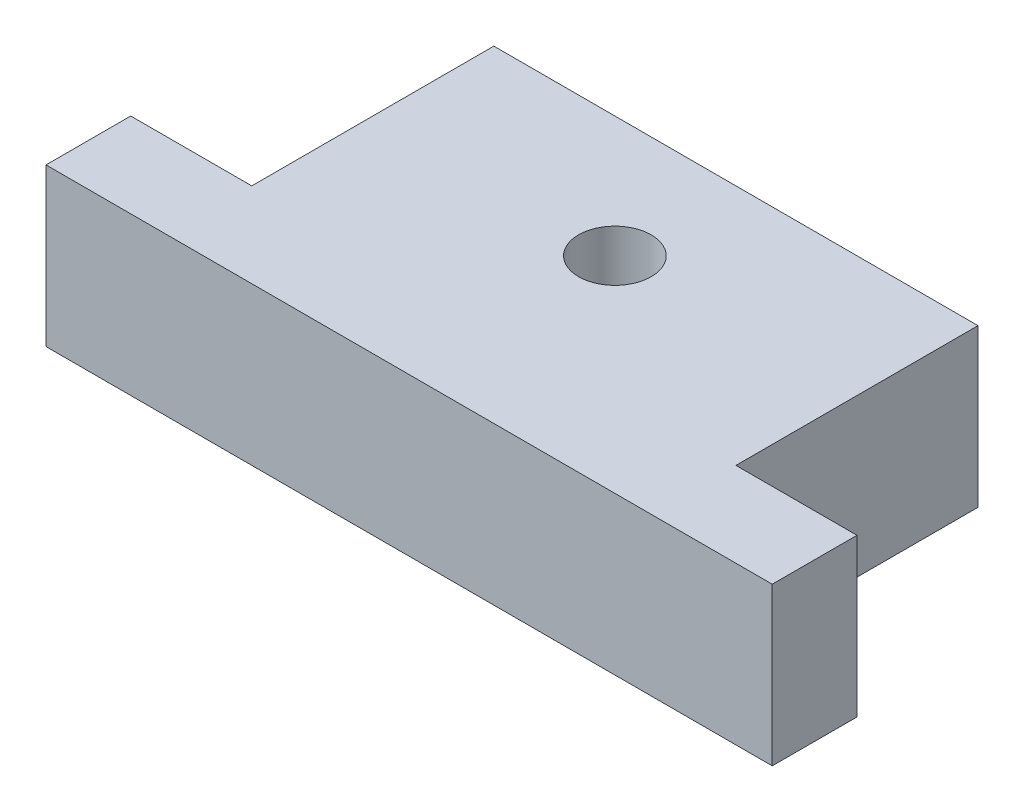
ISO-10303-21;
HEADER;
FILE_DESCRIPTION(('STEP AP214'),'2;1');
FILE_NAME('part.step','',(''),(''),'','','');
FILE_SCHEMA(('AUTOMOTIVE_DESIGN { 1 0 10303 214 1 1 1 1 }'));
ENDSEC;
DATA;
#1=APPLICATION_CONTEXT('core data for automotive mechanical design processes');
#2=APPLICATION_PROTOCOL_DEFINITION('international standard','automotive_design',2000,#1);
#3=PRODUCT_CONTEXT('',#1,'mechanical');
#4=PRODUCT('Part','Part','',(#3));
#5=PRODUCT_RELATED_PRODUCT_CATEGORY('part','',(#4));
#6=PRODUCT_DEFINITION_FORMATION('','',#4);
#7=PRODUCT_DEFINITION_CONTEXT('part definition',#1,'design');
#8=PRODUCT_DEFINITION('design','',#6,#7);
#9=PRODUCT_DEFINITION_SHAPE('','',#8);
#10=(LENGTH_UNIT() NAMED_UNIT(*) SI_UNIT(.MILLI.,.METRE.));
#11=(NAMED_UNIT(*) PLANE_ANGLE_UNIT() SI_UNIT($,.RADIAN.));
#12=(NAMED_UNIT(*) SI_UNIT($,.STERADIAN.) SOLID_ANGLE_UNIT());
#13=UNCERTAINTY_MEASURE_WITH_UNIT(LENGTH_MEASURE(1.E-05),#10,'distance_accuracy_value','');
#14=(GEOMETRIC_REPRESENTATION_CONTEXT(3) GLOBAL_UNCERTAINTY_ASSIGNED_CONTEXT((#13)) GLOBAL_UNIT_ASSIGNED_CONTEXT((#10,
#11,#12)) REPRESENTATION_CONTEXT('',''));
#15=CARTESIAN_POINT('',(0.,0.,0.));
#16=DIRECTION('',(0.,0.,1.));
#17=DIRECTION('',(1.,0.,0.));
#18=AXIS2_PLACEMENT_3D('',#15,#16,#17);
#19=CARTESIAN_POINT('',(0.,13.,0.));
#20=DIRECTION('',(0.,1.,0.));
#21=DIRECTION('',(0.,0.,1.));
#22=AXIS2_PLACEMENT_3D('',#19,#20,#21);
#23=PLANE('',#22);
#24=DIRECTION('',(0.,0.,1.));
#25=VECTOR('',#24,1.);
#26=CARTESIAN_POINT('',(-23.4363854227635,13.,-18.7907800020509));
#27=LINE('',#26,#25);
#28=CARTESIAN_POINT('',(-23.4363854227635,13.,-18.7907800020509));
#29=VERTEX_POINT('',#28);
#30=CARTESIAN_POINT('',(-23.4363854227636,13.,-11.7907800020509));
#31=VERTEX_POINT('',#30);
#32=EDGE_CURVE('E149',#29,#31,#27,.T.);
#33=ORIENTED_EDGE('',*,*,#32,.T.);
#34=DIRECTION('',(1.,0.,0.));
#35=VECTOR('',#34,1.);
#36=CARTESIAN_POINT('',(-23.4363854227636,13.,-11.7907800020509));
#37=LINE('',#36,#35);
#38=CARTESIAN_POINT('',(36.5636145772365,13.,-11.7907800020509));
#39=VERTEX_POINT('',#38);
#40=EDGE_CURVE('E97',#31,#39,#37,.T.);
#41=ORIENTED_EDGE('',*,*,#40,.T.);
#42=DIRECTION('',(0.,0.,-1.));
#43=VECTOR('',#42,1.);
#44=CARTESIAN_POINT('',(36.5636145772365,13.,-11.7907800020509));
#45=LINE('',#44,#43);
#46=CARTESIAN_POINT('',(36.5636145772365,13.,-18.7907800020509));
#47=VERTEX_POINT('',#46);
#48=EDGE_CURVE('E164',#39,#47,#45,.T.);
#49=ORIENTED_EDGE('',*,*,#48,.T.);
#50=DIRECTION('',(-1.,0.,0.));
#51=VECTOR('',#50,1.);
#52=CARTESIAN_POINT('',(36.5636145772365,13.,-18.7907800020509));
#53=LINE('',#52,#51);
#54=CARTESIAN_POINT('',(26.5636145772365,13.,-18.7907800020509));
#55=VERTEX_POINT('',#54);
#56=EDGE_CURVE('E177',#47,#55,#53,.T.);
#57=ORIENTED_EDGE('',*,*,#56,.T.);
#58=DIRECTION('',(0.,0.,-1.));
#59=VECTOR('',#58,1.);
#60=CARTESIAN_POINT('',(26.5636145772365,13.,-18.7907800020509));
#61=LINE('',#60,#59);
#62=CARTESIAN_POINT('',(26.5636145772365,13.,-38.7907800020509));
#63=VERTEX_POINT('',#62);
#64=EDGE_CURVE('E116',#55,#63,#61,.T.);
#65=ORIENTED_EDGE('',*,*,#64,.T.);
#66=DIRECTION('',(-1.,0.,0.));
#67=VECTOR('',#66,1.);
#68=CARTESIAN_POINT('',(26.5636145772365,13.,-38.7907800020509));
#69=LINE('',#68,#67);
#70=CARTESIAN_POINT('',(-13.4363854227635,13.,-38.7907800020509));
#71=VERTEX_POINT('',#70);
#72=EDGE_CURVE('E110',#63,#71,#69,.T.);
#73=ORIENTED_EDGE('',*,*,#72,.T.);
#74=DIRECTION('',(0.,0.,1.));
#75=VECTOR('',#74,1.);
#76=CARTESIAN_POINT('',(-13.4363854227635,13.,-38.7907800020509));
#77=LINE('',#76,#75);
#78=CARTESIAN_POINT('',(-13.4363854227635,13.,-18.7907800020509));
#79=VERTEX_POINT('',#78);
#80=EDGE_CURVE('E114',#71,#79,#77,.T.);
#81=ORIENTED_EDGE('',*,*,#80,.T.);
#82=DIRECTION('',(-1.,0.,0.));
#83=VECTOR('',#82,1.);
#84=CARTESIAN_POINT('',(-13.4363854227635,13.,-18.7907800020509));
#85=LINE('',#84,#83);
#86=EDGE_CURVE('E54',#79,#29,#85,.T.);
#87=ORIENTED_EDGE('',*,*,#86,.T.);
#88=EDGE_LOOP('',(#33,#41,#49,#57,#65,#73,#81,#87));
#89=FACE_BOUND('',#88,.T.);
#90=CARTESIAN_POINT('',(6.56361457723645,13.,-28.7907800020509));
#91=DIRECTION('',(0.,1.,0.));
#92=DIRECTION('',(0.,0.,1.));
#93=AXIS2_PLACEMENT_3D('',#90,#91,#92);
#94=CIRCLE('',#93,3.);
#95=CARTESIAN_POINT('',(6.56361457723645,13.,-25.7907800020509));
#96=VERTEX_POINT('',#95);
#97=EDGE_CURVE('E138',#96,#96,#94,.T.);
#98=ORIENTED_EDGE('',*,*,#97,.F.);
#99=EDGE_LOOP('',(#98));
#100=FACE_BOUND('',#99,.T.);
#101=ADVANCED_FACE('F37',(#89,#100),#23,.T.);
#102=CARTESIAN_POINT('',(0.,0.,0.));
#103=DIRECTION('',(0.,1.,0.));
#104=DIRECTION('',(0.,0.,1.));
#105=AXIS2_PLACEMENT_3D('',#102,#103,#104);
#106=PLANE('',#105);
#107=DIRECTION('',(0.,0.,1.));
#108=VECTOR('',#107,1.);
#109=CARTESIAN_POINT('',(-23.4363854227635,0.,-18.7907800020509));
#110=LINE('',#109,#108);
#111=CARTESIAN_POINT('',(-23.4363854227635,0.,-18.7907800020509));
#112=VERTEX_POINT('',#111);
#113=CARTESIAN_POINT('',(-23.4363854227636,0.,-11.7907800020509));
#114=VERTEX_POINT('',#113);
#115=EDGE_CURVE('E134',#112,#114,#110,.T.);
#116=ORIENTED_EDGE('',*,*,#115,.F.);
#117=DIRECTION('',(-1.,0.,0.));
#118=VECTOR('',#117,1.);
#119=CARTESIAN_POINT('',(-13.4363854227635,0.,-18.7907800020509));
#120=LINE('',#119,#118);
#121=CARTESIAN_POINT('',(-13.4363854227635,0.,-18.7907800020509));
#122=VERTEX_POINT('',#121);
#123=EDGE_CURVE('E89',#122,#112,#120,.T.);
#124=ORIENTED_EDGE('',*,*,#123,.F.);
#125=DIRECTION('',(0.,0.,1.));
#126=VECTOR('',#125,1.);
#127=CARTESIAN_POINT('',(-13.4363854227635,0.,-38.7907800020509));
#128=LINE('',#127,#126);
#129=CARTESIAN_POINT('',(-13.4363854227635,0.,-38.7907800020509));
#130=VERTEX_POINT('',#129);
#131=EDGE_CURVE('E83',#130,#122,#128,.T.);
#132=ORIENTED_EDGE('',*,*,#131,.F.);
#133=DIRECTION('',(-1.,0.,0.));
#134=VECTOR('',#133,1.);
#135=CARTESIAN_POINT('',(26.5636145772365,0.,-38.7907800020509));
#136=LINE('',#135,#134);
#137=CARTESIAN_POINT('',(26.5636145772365,0.,-38.7907800020509));
#138=VERTEX_POINT('',#137);
#139=EDGE_CURVE('E124',#138,#130,#136,.T.);
#140=ORIENTED_EDGE('',*,*,#139,.F.);
#141=DIRECTION('',(0.,0.,-1.));
#142=VECTOR('',#141,1.);
#143=CARTESIAN_POINT('',(26.5636145772365,0.,-18.7907800020509));
#144=LINE('',#143,#142);
#145=CARTESIAN_POINT('',(26.5636145772365,0.,-18.7907800020509));
#146=VERTEX_POINT('',#145);
#147=EDGE_CURVE('E144',#146,#138,#144,.T.);
#148=ORIENTED_EDGE('',*,*,#147,.F.);
#149=DIRECTION('',(-1.,0.,0.));
#150=VECTOR('',#149,1.);
#151=CARTESIAN_POINT('',(36.5636145772365,0.,-18.7907800020509));
#152=LINE('',#151,#150);
#153=CARTESIAN_POINT('',(36.5636145772365,0.,-18.7907800020509));
#154=VERTEX_POINT('',#153);
#155=EDGE_CURVE('E142',#154,#146,#152,.T.);
#156=ORIENTED_EDGE('',*,*,#155,.F.);
#157=DIRECTION('',(0.,0.,-1.));
#158=VECTOR('',#157,1.);
#159=CARTESIAN_POINT('',(36.5636145772365,0.,-11.7907800020509));
#160=LINE('',#159,#158);
#161=CARTESIAN_POINT('',(36.5636145772365,0.,-11.7907800020509));
#162=VERTEX_POINT('',#161);
#163=EDGE_CURVE('E140',#162,#154,#160,.T.);
#164=ORIENTED_EDGE('',*,*,#163,.F.);
#165=DIRECTION('',(1.,0.,0.));
#166=VECTOR('',#165,1.);
#167=CARTESIAN_POINT('',(-23.4363854227636,0.,-11.7907800020509));
#168=LINE('',#167,#166);
#169=EDGE_CURVE('E137',#114,#162,#168,.T.);
#170=ORIENTED_EDGE('',*,*,#169,.F.);
#171=EDGE_LOOP('',(#116,#124,#132,#140,#148,#156,#164,#170));
#172=FACE_BOUND('',#171,.T.);
#173=CARTESIAN_POINT('',(6.56361457723645,0.,-28.7907800020509));
#174=DIRECTION('',(0.,1.,0.));
#175=DIRECTION('',(0.,0.,1.));
#176=AXIS2_PLACEMENT_3D('',#173,#174,#175);
#177=CIRCLE('',#176,3.);
#178=CARTESIAN_POINT('',(6.56361457723645,0.,-25.7907800020509));
#179=VERTEX_POINT('',#178);
#180=EDGE_CURVE('E183',#179,#179,#177,.T.);
#181=ORIENTED_EDGE('',*,*,#180,.T.);
#182=EDGE_LOOP('',(#181));
#183=FACE_BOUND('',#182,.T.);
#184=ADVANCED_FACE('F168',(#172,#183),#106,.F.);
#185=CARTESIAN_POINT('',(-23.4363854227635,13.,-18.7907800020509));
#186=DIRECTION('',(1.,0.,0.));
#187=DIRECTION('',(0.,0.,-1.));
#188=AXIS2_PLACEMENT_3D('',#185,#186,#187);
#189=PLANE('',#188);
#190=ORIENTED_EDGE('',*,*,#115,.T.);
#191=DIRECTION('',(0.,-1.,0.));
#192=VECTOR('',#191,1.);
#193=CARTESIAN_POINT('',(-23.4363854227636,13.,-11.7907800020509));
#194=LINE('',#193,#192);
#195=EDGE_CURVE('E11',#31,#114,#194,.T.);
#196=ORIENTED_EDGE('',*,*,#195,.F.);
#197=ORIENTED_EDGE('',*,*,#32,.F.);
#198=DIRECTION('',(0.,-1.,0.));
#199=VECTOR('',#198,1.);
#200=CARTESIAN_POINT('',(-23.4363854227635,13.,-18.7907800020509));
#201=LINE('',#200,#199);
#202=EDGE_CURVE('E130',#29,#112,#201,.T.);
#203=ORIENTED_EDGE('',*,*,#202,.T.);
#204=EDGE_LOOP('',(#190,#196,#197,#203));
#205=FACE_BOUND('',#204,.T.);
#206=ADVANCED_FACE('F39',(#205),#189,.F.);
#207=CARTESIAN_POINT('',(-23.4363854227636,13.,-11.7907800020509));
#208=DIRECTION('',(0.,0.,-1.));
#209=DIRECTION('',(-1.,0.,0.));
#210=AXIS2_PLACEMENT_3D('',#207,#208,#209);
#211=PLANE('',#210);
#212=ORIENTED_EDGE('',*,*,#169,.T.);
#213=DIRECTION('',(0.,-1.,0.));
#214=VECTOR('',#213,1.);
#215=CARTESIAN_POINT('',(36.5636145772365,13.,-11.7907800020509));
#216=LINE('',#215,#214);
#217=EDGE_CURVE('E46',#39,#162,#216,.T.);
#218=ORIENTED_EDGE('',*,*,#217,.F.);
#219=ORIENTED_EDGE('',*,*,#40,.F.);
#220=ORIENTED_EDGE('',*,*,#195,.T.);
#221=EDGE_LOOP('',(#212,#218,#219,#220));
#222=FACE_BOUND('',#221,.T.);
#223=ADVANCED_FACE('F211',(#222),#211,.F.);
#224=CARTESIAN_POINT('',(36.5636145772365,13.,-11.7907800020509));
#225=DIRECTION('',(-1.,0.,0.));
#226=DIRECTION('',(0.,0.,1.));
#227=AXIS2_PLACEMENT_3D('',#224,#225,#226);
#228=PLANE('',#227);
#229=ORIENTED_EDGE('',*,*,#163,.T.);
#230=DIRECTION('',(0.,-1.,0.));
#231=VECTOR('',#230,1.);
#232=CARTESIAN_POINT('',(36.5636145772365,13.,-18.7907800020509));
#233=LINE('',#232,#231);
#234=EDGE_CURVE('E156',#47,#154,#233,.T.);
#235=ORIENTED_EDGE('',*,*,#234,.F.);
#236=ORIENTED_EDGE('',*,*,#48,.F.);
#237=ORIENTED_EDGE('',*,*,#217,.T.);
#238=EDGE_LOOP('',(#229,#235,#236,#237));
#239=FACE_BOUND('',#238,.T.);
#240=ADVANCED_FACE('F162',(#239),#228,.F.);
#241=CARTESIAN_POINT('',(36.5636145772365,13.,-18.7907800020509));
#242=DIRECTION('',(0.,0.,1.));
#243=DIRECTION('',(1.,0.,0.));
#244=AXIS2_PLACEMENT_3D('',#241,#242,#243);
#245=PLANE('',#244);
#246=ORIENTED_EDGE('',*,*,#155,.T.);
#247=DIRECTION('',(0.,-1.,0.));
#248=VECTOR('',#247,1.);
#249=CARTESIAN_POINT('',(26.5636145772365,13.,-18.7907800020509));
#250=LINE('',#249,#248);
#251=EDGE_CURVE('E153',#55,#146,#250,.T.);
#252=ORIENTED_EDGE('',*,*,#251,.F.);
#253=ORIENTED_EDGE('',*,*,#56,.F.);
#254=ORIENTED_EDGE('',*,*,#234,.T.);
#255=EDGE_LOOP('',(#246,#252,#253,#254));
#256=FACE_BOUND('',#255,.T.);
#257=ADVANCED_FACE('F173',(#256),#245,.F.);
#258=CARTESIAN_POINT('',(26.5636145772365,13.,-18.7907800020509));
#259=DIRECTION('',(-1.,0.,0.));
#260=DIRECTION('',(0.,0.,1.));
#261=AXIS2_PLACEMENT_3D('',#258,#259,#260);
#262=PLANE('',#261);
#263=ORIENTED_EDGE('',*,*,#147,.T.);
#264=DIRECTION('',(0.,-1.,0.));
#265=VECTOR('',#264,1.);
#266=CARTESIAN_POINT('',(26.5636145772365,13.,-38.7907800020509));
#267=LINE('',#266,#265);
#268=EDGE_CURVE('E125',#63,#138,#267,.T.);
#269=ORIENTED_EDGE('',*,*,#268,.F.);
#270=ORIENTED_EDGE('',*,*,#64,.F.);
#271=ORIENTED_EDGE('',*,*,#251,.T.);
#272=EDGE_LOOP('',(#263,#269,#270,#271));
#273=FACE_BOUND('',#272,.T.);
#274=ADVANCED_FACE('F176',(#273),#262,.F.);
#275=CARTESIAN_POINT('',(26.5636145772365,13.,-38.7907800020509));
#276=DIRECTION('',(0.,0.,1.));
#277=DIRECTION('',(1.,0.,0.));
#278=AXIS2_PLACEMENT_3D('',#275,#276,#277);
#279=PLANE('',#278);
#280=ORIENTED_EDGE('',*,*,#139,.T.);
#281=DIRECTION('',(0.,-1.,0.));
#282=VECTOR('',#281,1.);
#283=CARTESIAN_POINT('',(-13.4363854227635,13.,-38.7907800020509));
#284=LINE('',#283,#282);
#285=EDGE_CURVE('E121',#71,#130,#284,.T.);
#286=ORIENTED_EDGE('',*,*,#285,.F.);
#287=ORIENTED_EDGE('',*,*,#72,.F.);
#288=ORIENTED_EDGE('',*,*,#268,.T.);
#289=EDGE_LOOP('',(#280,#286,#287,#288));
#290=FACE_BOUND('',#289,.T.);
#291=ADVANCED_FACE('F122',(#290),#279,.F.);
#292=CARTESIAN_POINT('',(-13.4363854227635,13.,-38.7907800020509));
#293=DIRECTION('',(1.,0.,0.));
#294=DIRECTION('',(0.,0.,-1.));
#295=AXIS2_PLACEMENT_3D('',#292,#293,#294);
#296=PLANE('',#295);
#297=ORIENTED_EDGE('',*,*,#131,.T.);
#298=DIRECTION('',(0.,-1.,0.));
#299=VECTOR('',#298,1.);
#300=CARTESIAN_POINT('',(-13.4363854227635,13.,-18.7907800020509));
#301=LINE('',#300,#299);
#302=EDGE_CURVE('E126',#79,#122,#301,.T.);
#303=ORIENTED_EDGE('',*,*,#302,.F.);
#304=ORIENTED_EDGE('',*,*,#80,.F.);
#305=ORIENTED_EDGE('',*,*,#285,.T.);
#306=EDGE_LOOP('',(#297,#303,#304,#305));
#307=FACE_BOUND('',#306,.T.);
#308=ADVANCED_FACE('F128',(#307),#296,.F.);
#309=CARTESIAN_POINT('',(-13.4363854227635,13.,-18.7907800020509));
#310=DIRECTION('',(0.,0.,1.));
#311=DIRECTION('',(1.,0.,0.));
#312=AXIS2_PLACEMENT_3D('',#309,#310,#311);
#313=PLANE('',#312);
#314=ORIENTED_EDGE('',*,*,#123,.T.);
#315=ORIENTED_EDGE('',*,*,#202,.F.);
#316=ORIENTED_EDGE('',*,*,#86,.F.);
#317=ORIENTED_EDGE('',*,*,#302,.T.);
#318=EDGE_LOOP('',(#314,#315,#316,#317));
#319=FACE_BOUND('',#318,.T.);
#320=ADVANCED_FACE('F199',(#319),#313,.F.);
#321=CARTESIAN_POINT('',(6.56361457723645,13.,-28.7907800020509));
#322=DIRECTION('',(0.,-1.,0.));
#323=DIRECTION('',(0.,0.,-1.));
#324=AXIS2_PLACEMENT_3D('',#321,#322,#323);
#325=CYLINDRICAL_SURFACE('',#324,3.);
#326=ORIENTED_EDGE('',*,*,#97,.T.);
#327=EDGE_LOOP('',(#326));
#328=FACE_BOUND('',#327,.T.);
#329=ORIENTED_EDGE('',*,*,#180,.F.);
#330=EDGE_LOOP('',(#329));
#331=FACE_BOUND('',#330,.T.);
#332=ADVANCED_FACE('F189',(#328,#331),#325,.F.);
#333=CLOSED_SHELL('',(#101,#184,#206,#223,#240,#257,#274,#291,#308,#320,#332));
#334=MANIFOLD_SOLID_BREP('B2',#333);
#335=ADVANCED_BREP_SHAPE_REPRESENTATION('',(#18,#334),#14);
#336=SHAPE_DEFINITION_REPRESENTATION(#9,#335);
ENDSEC;
END-ISO-10303-21;
